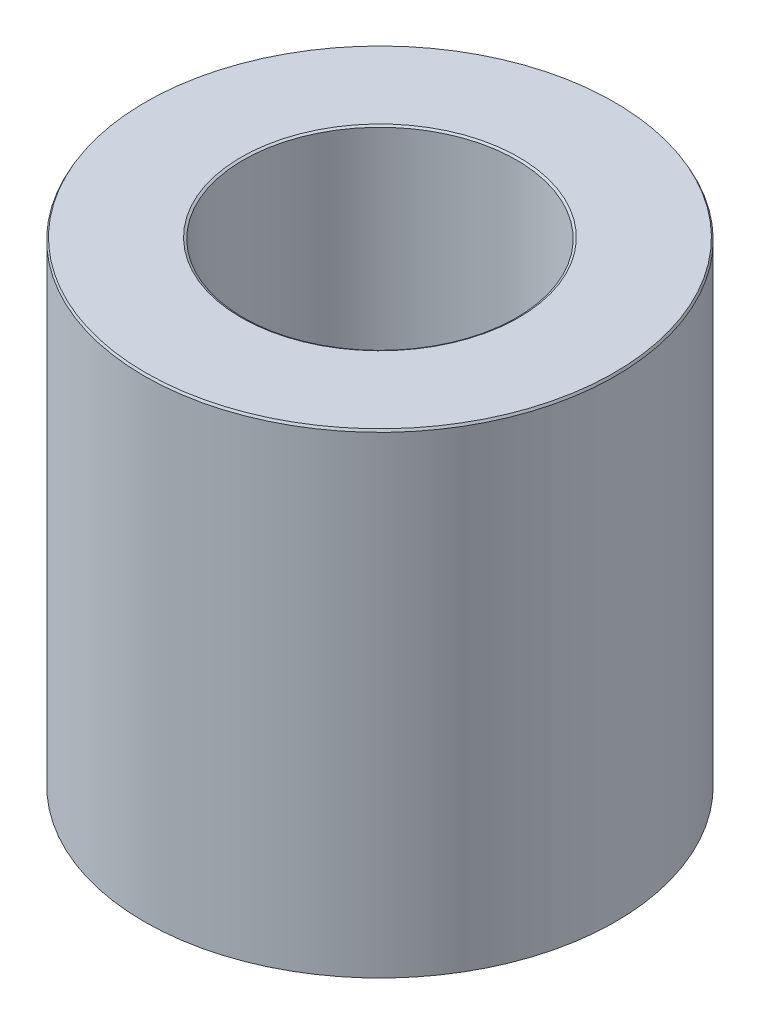
ISO-10303-21;
HEADER;
FILE_DESCRIPTION(('STEP AP214'),'2;1');
FILE_NAME('part.step','',(''),(''),'','','');
FILE_SCHEMA(('AUTOMOTIVE_DESIGN { 1 0 10303 214 1 1 1 1 }'));
ENDSEC;
DATA;
#1=APPLICATION_CONTEXT('core data for automotive mechanical design processes');
#2=APPLICATION_PROTOCOL_DEFINITION('international standard','automotive_design',2000,#1);
#3=PRODUCT_CONTEXT('',#1,'mechanical');
#4=PRODUCT('Part','Part','',(#3));
#5=PRODUCT_RELATED_PRODUCT_CATEGORY('part','',(#4));
#6=PRODUCT_DEFINITION_FORMATION('','',#4);
#7=PRODUCT_DEFINITION_CONTEXT('part definition',#1,'design');
#8=PRODUCT_DEFINITION('design','',#6,#7);
#9=PRODUCT_DEFINITION_SHAPE('','',#8);
#10=(LENGTH_UNIT() NAMED_UNIT(*) SI_UNIT(.MILLI.,.METRE.));
#11=(NAMED_UNIT(*) PLANE_ANGLE_UNIT() SI_UNIT($,.RADIAN.));
#12=(NAMED_UNIT(*) SI_UNIT($,.STERADIAN.) SOLID_ANGLE_UNIT());
#13=UNCERTAINTY_MEASURE_WITH_UNIT(LENGTH_MEASURE(1.E-05),#10,'distance_accuracy_value','');
#14=(GEOMETRIC_REPRESENTATION_CONTEXT(3) GLOBAL_UNCERTAINTY_ASSIGNED_CONTEXT((#13)) GLOBAL_UNIT_ASSIGNED_CONTEXT((#10,
#11,#12)) REPRESENTATION_CONTEXT('',''));
#15=CARTESIAN_POINT('',(0.,0.,0.));
#16=DIRECTION('',(0.,0.,1.));
#17=DIRECTION('',(1.,0.,0.));
#18=AXIS2_PLACEMENT_3D('',#15,#16,#17);
#19=CARTESIAN_POINT('',(0.,95.9612142598342,0.));
#20=DIRECTION('',(0.,-1.,0.));
#21=DIRECTION('',(0.,0.,-1.));
#22=AXIS2_PLACEMENT_3D('',#19,#20,#21);
#23=CYLINDRICAL_SURFACE('',#22,47.5);
#24=CARTESIAN_POINT('',(0.,0.254468340847261,0.));
#25=DIRECTION('',(0.,1.,0.));
#26=DIRECTION('',(0.,0.,1.));
#27=AXIS2_PLACEMENT_3D('',#24,#25,#26);
#28=CIRCLE('',#27,47.5);
#29=CARTESIAN_POINT('',(0.,0.254468340847261,47.5));
#30=VERTEX_POINT('',#29);
#31=EDGE_CURVE('E10',#30,#30,#28,.T.);
#32=ORIENTED_EDGE('',*,*,#31,.T.);
#33=EDGE_LOOP('',(#32));
#34=FACE_BOUND('',#33,.T.);
#35=CARTESIAN_POINT('',(0.,95.5073024957393,0.));
#36=DIRECTION('',(0.,1.,0.));
#37=DIRECTION('',(0.,0.,1.));
#38=AXIS2_PLACEMENT_3D('',#35,#36,#37);
#39=CIRCLE('',#38,47.5);
#40=CARTESIAN_POINT('',(0.,95.5073024957393,47.5));
#41=VERTEX_POINT('',#40);
#42=EDGE_CURVE('E50',#41,#41,#39,.F.);
#43=ORIENTED_EDGE('',*,*,#42,.T.);
#44=EDGE_LOOP('',(#43));
#45=FACE_BOUND('',#44,.T.);
#46=ADVANCED_FACE('F39',(#34,#45),#23,.T.);
#47=CARTESIAN_POINT('',(0.,95.9612142598342,0.));
#48=DIRECTION('',(0.,1.,0.));
#49=DIRECTION('',(0.,0.,1.));
#50=AXIS2_PLACEMENT_3D('',#47,#48,#49);
#51=PLANE('',#50);
#52=CARTESIAN_POINT('',(0.,95.9612142598342,0.));
#53=DIRECTION('',(0.,1.,0.));
#54=DIRECTION('',(0.,0.,1.));
#55=AXIS2_PLACEMENT_3D('',#52,#53,#54);
#56=CIRCLE('',#55,27.9961663317861);
#57=CARTESIAN_POINT('',(0.,95.9612142598342,27.9961663317861));
#58=VERTEX_POINT('',#57);
#59=EDGE_CURVE('E58',#58,#58,#56,.F.);
#60=ORIENTED_EDGE('',*,*,#59,.T.);
#61=EDGE_LOOP('',(#60));
#62=FACE_BOUND('',#61,.T.);
#63=CARTESIAN_POINT('',(0.,95.9612142598342,0.));
#64=DIRECTION('',(0.,1.,0.));
#65=DIRECTION('',(0.,0.,1.));
#66=AXIS2_PLACEMENT_3D('',#63,#64,#65);
#67=CIRCLE('',#66,47.2455316591527);
#68=CARTESIAN_POINT('',(0.,95.9612142598342,47.2455316591527));
#69=VERTEX_POINT('',#68);
#70=EDGE_CURVE('E61',#69,#69,#67,.T.);
#71=ORIENTED_EDGE('',*,*,#70,.T.);
#72=EDGE_LOOP('',(#71));
#73=FACE_BOUND('',#72,.T.);
#74=ADVANCED_FACE('F88',(#62,#73),#51,.T.);
#75=CARTESIAN_POINT('',(0.,0.,0.));
#76=DIRECTION('',(0.,1.,0.));
#77=DIRECTION('',(0.,0.,1.));
#78=AXIS2_PLACEMENT_3D('',#75,#76,#77);
#79=PLANE('',#78);
#80=CARTESIAN_POINT('',(0.,0.,0.));
#81=DIRECTION('',(0.,1.,0.));
#82=DIRECTION('',(0.,0.,1.));
#83=AXIS2_PLACEMENT_3D('',#80,#81,#82);
#84=CIRCLE('',#83,27.7967229085385);
#85=CARTESIAN_POINT('',(0.,0.,27.7967229085385));
#86=VERTEX_POINT('',#85);
#87=EDGE_CURVE('E51',#86,#86,#84,.T.);
#88=ORIENTED_EDGE('',*,*,#87,.T.);
#89=EDGE_LOOP('',(#88));
#90=FACE_BOUND('',#89,.T.);
#91=CARTESIAN_POINT('',(0.,0.,0.));
#92=DIRECTION('',(0.,1.,0.));
#93=DIRECTION('',(0.,0.,1.));
#94=AXIS2_PLACEMENT_3D('',#91,#92,#93);
#95=CIRCLE('',#94,47.0460882359051);
#96=CARTESIAN_POINT('',(0.,0.,47.0460882359051));
#97=VERTEX_POINT('',#96);
#98=EDGE_CURVE('E54',#97,#97,#95,.F.);
#99=ORIENTED_EDGE('',*,*,#98,.T.);
#100=EDGE_LOOP('',(#99));
#101=FACE_BOUND('',#100,.T.);
#102=ADVANCED_FACE('F83',(#90,#101),#79,.F.);
#103=CARTESIAN_POINT('',(0.,95.9612142598342,0.));
#104=DIRECTION('',(0.,-1.,0.));
#105=DIRECTION('',(0.,0.,-1.));
#106=AXIS2_PLACEMENT_3D('',#103,#104,#105);
#107=CYLINDRICAL_SURFACE('',#106,27.5422545676913);
#108=CARTESIAN_POINT('',(0.,95.706745918987,0.));
#109=DIRECTION('',(0.,1.,0.));
#110=DIRECTION('',(0.,0.,1.));
#111=AXIS2_PLACEMENT_3D('',#108,#109,#110);
#112=CIRCLE('',#111,27.5422545676913);
#113=CARTESIAN_POINT('',(0.,95.706745918987,27.5422545676913));
#114=VERTEX_POINT('',#113);
#115=EDGE_CURVE('E67',#114,#114,#112,.T.);
#116=ORIENTED_EDGE('',*,*,#115,.T.);
#117=EDGE_LOOP('',(#116));
#118=FACE_BOUND('',#117,.T.);
#119=CARTESIAN_POINT('',(0.,0.453911764094872,0.));
#120=DIRECTION('',(0.,1.,0.));
#121=DIRECTION('',(0.,0.,1.));
#122=AXIS2_PLACEMENT_3D('',#119,#120,#121);
#123=CIRCLE('',#122,27.5422545676913);
#124=CARTESIAN_POINT('',(0.,0.453911764094872,27.5422545676913));
#125=VERTEX_POINT('',#124);
#126=EDGE_CURVE('E69',#125,#125,#123,.F.);
#127=ORIENTED_EDGE('',*,*,#126,.T.);
#128=EDGE_LOOP('',(#127));
#129=FACE_BOUND('',#128,.T.);
#130=ADVANCED_FACE('F71',(#118,#129),#107,.F.);
#131=CARTESIAN_POINT('',(0.,95.706745918987,0.));
#132=DIRECTION('',(0.,1.,0.));
#133=DIRECTION('',(0.,0.,1.));
#134=AXIS2_PLACEMENT_3D('',#131,#132,#133);
#135=CONICAL_SURFACE('',#134,27.5422545676913,1.05984229998566);
#136=ORIENTED_EDGE('',*,*,#59,.F.);
#137=EDGE_LOOP('',(#136));
#138=FACE_BOUND('',#137,.T.);
#139=ORIENTED_EDGE('',*,*,#115,.F.);
#140=EDGE_LOOP('',(#139));
#141=FACE_BOUND('',#140,.T.);
#142=ADVANCED_FACE('F77',(#138,#141),#135,.F.);
#143=CARTESIAN_POINT('',(0.,0.,0.));
#144=DIRECTION('',(0.,-1.,0.));
#145=DIRECTION('',(0.,0.,-1.));
#146=AXIS2_PLACEMENT_3D('',#143,#144,#145);
#147=CONICAL_SURFACE('',#146,27.7967229085385,0.510954026809261);
#148=ORIENTED_EDGE('',*,*,#126,.F.);
#149=EDGE_LOOP('',(#148));
#150=FACE_BOUND('',#149,.T.);
#151=ORIENTED_EDGE('',*,*,#87,.F.);
#152=EDGE_LOOP('',(#151));
#153=FACE_BOUND('',#152,.T.);
#154=ADVANCED_FACE('F73',(#150,#153),#147,.F.);
#155=CARTESIAN_POINT('',(0.,0.254468340847261,0.));
#156=DIRECTION('',(0.,1.,0.));
#157=DIRECTION('',(0.,0.,1.));
#158=AXIS2_PLACEMENT_3D('',#155,#156,#157);
#159=CONICAL_SURFACE('',#158,47.5,1.05984229998565);
#160=ORIENTED_EDGE('',*,*,#98,.F.);
#161=EDGE_LOOP('',(#160));
#162=FACE_BOUND('',#161,.T.);
#163=ORIENTED_EDGE('',*,*,#31,.F.);
#164=EDGE_LOOP('',(#163));
#165=FACE_BOUND('',#164,.T.);
#166=ADVANCED_FACE('F76',(#162,#165),#159,.T.);
#167=CARTESIAN_POINT('',(0.,95.9612142598342,0.));
#168=DIRECTION('',(0.,-1.,0.));
#169=DIRECTION('',(0.,0.,-1.));
#170=AXIS2_PLACEMENT_3D('',#167,#168,#169);
#171=CONICAL_SURFACE('',#170,47.2455316591527,0.510954026809252);
#172=ORIENTED_EDGE('',*,*,#42,.F.);
#173=EDGE_LOOP('',(#172));
#174=FACE_BOUND('',#173,.T.);
#175=ORIENTED_EDGE('',*,*,#70,.F.);
#176=EDGE_LOOP('',(#175));
#177=FACE_BOUND('',#176,.T.);
#178=ADVANCED_FACE('F45',(#174,#177),#171,.T.);
#179=CLOSED_SHELL('',(#46,#74,#102,#130,#142,#154,#166,#178));
#180=MANIFOLD_SOLID_BREP('B2',#179);
#181=ADVANCED_BREP_SHAPE_REPRESENTATION('',(#18,#180),#14);
#182=SHAPE_DEFINITION_REPRESENTATION(#9,#181);
ENDSEC;
END-ISO-10303-21;
